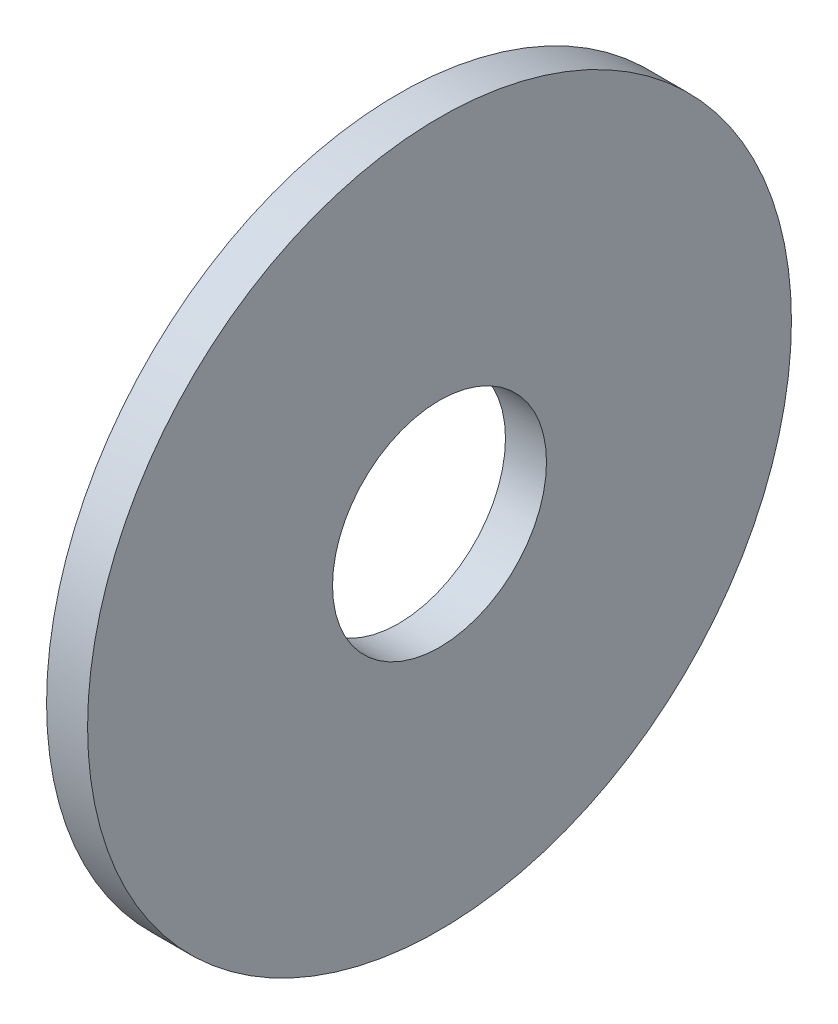
ISO-10303-21;
HEADER;
FILE_DESCRIPTION(('STEP AP214'),'2;1');
FILE_NAME('part.step','',(''),(''),'','','');
FILE_SCHEMA(('AUTOMOTIVE_DESIGN { 1 0 10303 214 1 1 1 1 }'));
ENDSEC;
DATA;
#1=APPLICATION_CONTEXT('core data for automotive mechanical design processes');
#2=APPLICATION_PROTOCOL_DEFINITION('international standard','automotive_design',2000,#1);
#3=PRODUCT_CONTEXT('',#1,'mechanical');
#4=PRODUCT('Part','Part','',(#3));
#5=PRODUCT_RELATED_PRODUCT_CATEGORY('part','',(#4));
#6=PRODUCT_DEFINITION_FORMATION('','',#4);
#7=PRODUCT_DEFINITION_CONTEXT('part definition',#1,'design');
#8=PRODUCT_DEFINITION('design','',#6,#7);
#9=PRODUCT_DEFINITION_SHAPE('','',#8);
#10=(LENGTH_UNIT() NAMED_UNIT(*) SI_UNIT(.MILLI.,.METRE.));
#11=(NAMED_UNIT(*) PLANE_ANGLE_UNIT() SI_UNIT($,.RADIAN.));
#12=(NAMED_UNIT(*) SI_UNIT($,.STERADIAN.) SOLID_ANGLE_UNIT());
#13=UNCERTAINTY_MEASURE_WITH_UNIT(LENGTH_MEASURE(1.E-05),#10,'distance_accuracy_value','');
#14=(GEOMETRIC_REPRESENTATION_CONTEXT(3) GLOBAL_UNCERTAINTY_ASSIGNED_CONTEXT((#13)) GLOBAL_UNIT_ASSIGNED_CONTEXT((#10,
#11,#12)) REPRESENTATION_CONTEXT('',''));
#15=CARTESIAN_POINT('',(0.,0.,0.));
#16=DIRECTION('',(0.,0.,1.));
#17=DIRECTION('',(1.,0.,0.));
#18=AXIS2_PLACEMENT_3D('',#15,#16,#17);
#19=CARTESIAN_POINT('',(1.2954,0.,0.));
#20=DIRECTION('',(1.,0.,0.));
#21=DIRECTION('',(0.,0.,-1.));
#22=AXIS2_PLACEMENT_3D('',#19,#20,#21);
#23=PLANE('',#22);
#24=CARTESIAN_POINT('',(1.2954,0.,0.));
#25=DIRECTION('',(1.,0.,0.));
#26=DIRECTION('',(0.,0.,-1.));
#27=AXIS2_PLACEMENT_3D('',#24,#25,#26);
#28=CIRCLE('',#27,11.1125);
#29=CARTESIAN_POINT('',(1.2954,0.,-11.1125));
#30=VERTEX_POINT('',#29);
#31=EDGE_CURVE('E10',#30,#30,#28,.T.);
#32=ORIENTED_EDGE('',*,*,#31,.T.);
#33=EDGE_LOOP('',(#32));
#34=FACE_BOUND('',#33,.T.);
#35=CARTESIAN_POINT('',(1.2954,0.,0.));
#36=DIRECTION('',(1.,0.,0.));
#37=DIRECTION('',(0.,0.,-1.));
#38=AXIS2_PLACEMENT_3D('',#35,#36,#37);
#39=CIRCLE('',#38,3.3782);
#40=CARTESIAN_POINT('',(1.2954,0.,-3.3782));
#41=VERTEX_POINT('',#40);
#42=EDGE_CURVE('E41',#41,#41,#39,.T.);
#43=ORIENTED_EDGE('',*,*,#42,.F.);
#44=EDGE_LOOP('',(#43));
#45=FACE_BOUND('',#44,.T.);
#46=ADVANCED_FACE('F30',(#34,#45),#23,.T.);
#47=CARTESIAN_POINT('',(0.,0.,0.));
#48=DIRECTION('',(1.,0.,0.));
#49=DIRECTION('',(0.,0.,-1.));
#50=AXIS2_PLACEMENT_3D('',#47,#48,#49);
#51=PLANE('',#50);
#52=CARTESIAN_POINT('',(0.,0.,0.));
#53=DIRECTION('',(1.,0.,0.));
#54=DIRECTION('',(0.,0.,-1.));
#55=AXIS2_PLACEMENT_3D('',#52,#53,#54);
#56=CIRCLE('',#55,11.1125);
#57=CARTESIAN_POINT('',(0.,0.,-11.1125));
#58=VERTEX_POINT('',#57);
#59=EDGE_CURVE('E34',#58,#58,#56,.T.);
#60=ORIENTED_EDGE('',*,*,#59,.F.);
#61=EDGE_LOOP('',(#60));
#62=FACE_BOUND('',#61,.T.);
#63=CARTESIAN_POINT('',(0.,0.,0.));
#64=DIRECTION('',(1.,0.,0.));
#65=DIRECTION('',(0.,0.,-1.));
#66=AXIS2_PLACEMENT_3D('',#63,#64,#65);
#67=CIRCLE('',#66,3.3782);
#68=CARTESIAN_POINT('',(0.,0.,-3.3782));
#69=VERTEX_POINT('',#68);
#70=EDGE_CURVE('E43',#69,#69,#67,.T.);
#71=ORIENTED_EDGE('',*,*,#70,.T.);
#72=EDGE_LOOP('',(#71));
#73=FACE_BOUND('',#72,.T.);
#74=ADVANCED_FACE('F53',(#62,#73),#51,.F.);
#75=CARTESIAN_POINT('',(1.2954,0.,0.));
#76=DIRECTION('',(-1.,0.,0.));
#77=DIRECTION('',(0.,0.,1.));
#78=AXIS2_PLACEMENT_3D('',#75,#76,#77);
#79=CYLINDRICAL_SURFACE('',#78,11.1125);
#80=ORIENTED_EDGE('',*,*,#31,.F.);
#81=EDGE_LOOP('',(#80));
#82=FACE_BOUND('',#81,.T.);
#83=ORIENTED_EDGE('',*,*,#59,.T.);
#84=EDGE_LOOP('',(#83));
#85=FACE_BOUND('',#84,.T.);
#86=ADVANCED_FACE('F32',(#82,#85),#79,.T.);
#87=CARTESIAN_POINT('',(1.2954,0.,0.));
#88=DIRECTION('',(-1.,0.,0.));
#89=DIRECTION('',(0.,0.,1.));
#90=AXIS2_PLACEMENT_3D('',#87,#88,#89);
#91=CYLINDRICAL_SURFACE('',#90,3.3782);
#92=ORIENTED_EDGE('',*,*,#42,.T.);
#93=EDGE_LOOP('',(#92));
#94=FACE_BOUND('',#93,.T.);
#95=ORIENTED_EDGE('',*,*,#70,.F.);
#96=EDGE_LOOP('',(#95));
#97=FACE_BOUND('',#96,.T.);
#98=ADVANCED_FACE('F49',(#94,#97),#91,.F.);
#99=CLOSED_SHELL('',(#46,#74,#86,#98));
#100=MANIFOLD_SOLID_BREP('B2',#99);
#101=ADVANCED_BREP_SHAPE_REPRESENTATION('',(#18,#100),#14);
#102=SHAPE_DEFINITION_REPRESENTATION(#9,#101);
ENDSEC;
END-ISO-10303-21;
